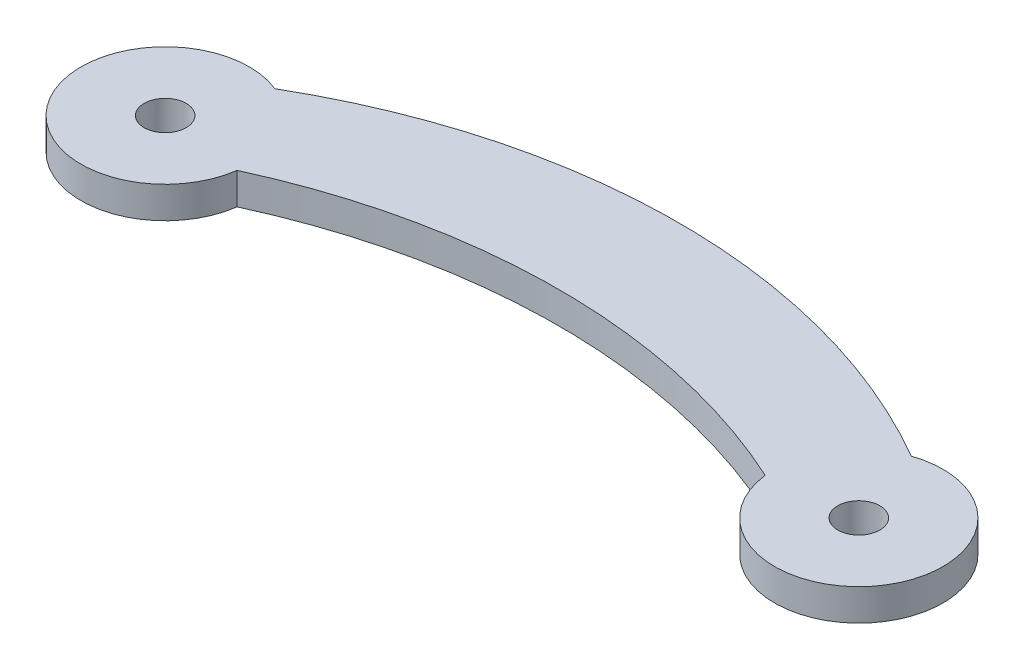
ISO-10303-21;
HEADER;
FILE_DESCRIPTION(('STEP AP214'),'2;1');
FILE_NAME('part.step','',(''),(''),'','','');
FILE_SCHEMA(('AUTOMOTIVE_DESIGN { 1 0 10303 214 1 1 1 1 }'));
ENDSEC;
DATA;
#1=APPLICATION_CONTEXT('core data for automotive mechanical design processes');
#2=APPLICATION_PROTOCOL_DEFINITION('international standard','automotive_design',2000,#1);
#3=PRODUCT_CONTEXT('',#1,'mechanical');
#4=PRODUCT('Part','Part','',(#3));
#5=PRODUCT_RELATED_PRODUCT_CATEGORY('part','',(#4));
#6=PRODUCT_DEFINITION_FORMATION('','',#4);
#7=PRODUCT_DEFINITION_CONTEXT('part definition',#1,'design');
#8=PRODUCT_DEFINITION('design','',#6,#7);
#9=PRODUCT_DEFINITION_SHAPE('','',#8);
#10=(LENGTH_UNIT() NAMED_UNIT(*) SI_UNIT(.MILLI.,.METRE.));
#11=(NAMED_UNIT(*) PLANE_ANGLE_UNIT() SI_UNIT($,.RADIAN.));
#12=(NAMED_UNIT(*) SI_UNIT($,.STERADIAN.) SOLID_ANGLE_UNIT());
#13=UNCERTAINTY_MEASURE_WITH_UNIT(LENGTH_MEASURE(1.E-05),#10,'distance_accuracy_value','');
#14=(GEOMETRIC_REPRESENTATION_CONTEXT(3) GLOBAL_UNCERTAINTY_ASSIGNED_CONTEXT((#13)) GLOBAL_UNIT_ASSIGNED_CONTEXT((#10,
#11,#12)) REPRESENTATION_CONTEXT('',''));
#15=CARTESIAN_POINT('',(0.,0.,0.));
#16=DIRECTION('',(0.,0.,1.));
#17=DIRECTION('',(1.,0.,0.));
#18=AXIS2_PLACEMENT_3D('',#15,#16,#17);
#19=CARTESIAN_POINT('',(16.6042481961613,1.5,22.2185711703313));
#20=DIRECTION('',(0.,-1.,0.));
#21=DIRECTION('',(0.,0.,-1.));
#22=AXIS2_PLACEMENT_3D('',#19,#20,#21);
#23=CYLINDRICAL_SURFACE('',#22,30.);
#24=CARTESIAN_POINT('',(16.6042481961613,0.,22.2185711703313));
#25=DIRECTION('',(0.,1.,0.));
#26=DIRECTION('',(0.,0.,-1.));
#27=AXIS2_PLACEMENT_3D('',#24,#25,#26);
#28=CIRCLE('',#27,30.);
#29=CARTESIAN_POINT('',(31.702043975481,0.,-3.70548257529189));
#30=VERTEX_POINT('',#29);
#31=CARTESIAN_POINT('',(1.5064524168417,0.,-3.70548257529189));
#32=VERTEX_POINT('',#31);
#33=EDGE_CURVE('E114',#30,#32,#28,.T.);
#34=ORIENTED_EDGE('',*,*,#33,.T.);
#35=DIRECTION('',(0.,-1.,0.));
#36=VECTOR('',#35,1.);
#37=CARTESIAN_POINT('',(1.5064524168417,1.5,-3.70548257529189));
#38=LINE('',#37,#36);
#39=CARTESIAN_POINT('',(1.5064524168417,1.5,-3.70548257529189));
#40=VERTEX_POINT('',#39);
#41=EDGE_CURVE('E11',#40,#32,#38,.T.);
#42=ORIENTED_EDGE('',*,*,#41,.F.);
#43=CARTESIAN_POINT('',(16.6042481961613,1.5,22.2185711703313));
#44=DIRECTION('',(0.,1.,0.));
#45=DIRECTION('',(0.,0.,-1.));
#46=AXIS2_PLACEMENT_3D('',#43,#44,#45);
#47=CIRCLE('',#46,30.);
#48=CARTESIAN_POINT('',(31.702043975481,1.5,-3.70548257529189));
#49=VERTEX_POINT('',#48);
#50=EDGE_CURVE('E97',#49,#40,#47,.T.);
#51=ORIENTED_EDGE('',*,*,#50,.F.);
#52=DIRECTION('',(0.,-1.,0.));
#53=VECTOR('',#52,1.);
#54=CARTESIAN_POINT('',(31.702043975481,1.5,-3.70548257529189));
#55=LINE('',#54,#53);
#56=EDGE_CURVE('E110',#49,#30,#55,.T.);
#57=ORIENTED_EDGE('',*,*,#56,.T.);
#58=EDGE_LOOP('',(#34,#42,#51,#57));
#59=FACE_BOUND('',#58,.T.);
#60=ADVANCED_FACE('F43',(#59),#23,.T.);
#61=CARTESIAN_POINT('',(0.,1.5,0.));
#62=DIRECTION('',(0.,-1.,0.));
#63=DIRECTION('',(0.,0.,-1.));
#64=AXIS2_PLACEMENT_3D('',#61,#62,#63);
#65=CYLINDRICAL_SURFACE('',#64,4.);
#66=CARTESIAN_POINT('',(0.,0.,0.));
#67=DIRECTION('',(0.,1.,0.));
#68=DIRECTION('',(0.,0.,1.));
#69=AXIS2_PLACEMENT_3D('',#66,#67,#68);
#70=CIRCLE('',#69,4.);
#71=CARTESIAN_POINT('',(3.96226825190421,0.,0.548115225068557));
#72=VERTEX_POINT('',#71);
#73=EDGE_CURVE('E102',#32,#72,#70,.T.);
#74=ORIENTED_EDGE('',*,*,#73,.T.);
#75=DIRECTION('',(0.,-1.,0.));
#76=VECTOR('',#75,1.);
#77=CARTESIAN_POINT('',(3.96226825190421,1.5,0.548115225068557));
#78=LINE('',#77,#76);
#79=CARTESIAN_POINT('',(3.96226825190421,1.5,0.548115225068557));
#80=VERTEX_POINT('',#79);
#81=EDGE_CURVE('E53',#80,#72,#78,.T.);
#82=ORIENTED_EDGE('',*,*,#81,.F.);
#83=CARTESIAN_POINT('',(0.,1.5,0.));
#84=DIRECTION('',(0.,1.,0.));
#85=DIRECTION('',(0.,0.,1.));
#86=AXIS2_PLACEMENT_3D('',#83,#84,#85);
#87=CIRCLE('',#86,4.);
#88=EDGE_CURVE('E92',#40,#80,#87,.T.);
#89=ORIENTED_EDGE('',*,*,#88,.F.);
#90=ORIENTED_EDGE('',*,*,#41,.T.);
#91=EDGE_LOOP('',(#74,#82,#89,#90));
#92=FACE_BOUND('',#91,.T.);
#93=ADVANCED_FACE('F101',(#92),#65,.T.);
#94=CARTESIAN_POINT('',(16.4949907232611,1.5,27.8048734229164));
#95=DIRECTION('',(0.,-1.,0.));
#96=DIRECTION('',(0.,0.,-1.));
#97=AXIS2_PLACEMENT_3D('',#94,#95,#96);
#98=CYLINDRICAL_SURFACE('',#97,30.);
#99=CARTESIAN_POINT('',(16.4949907232611,0.,27.8048734229164));
#100=DIRECTION('',(0.,-1.,0.));
#101=DIRECTION('',(0.,0.,-1.));
#102=AXIS2_PLACEMENT_3D('',#99,#100,#101);
#103=CIRCLE('',#102,30.);
#104=CARTESIAN_POINT('',(29.027713194618,0.,0.548115225068559));
#105=VERTEX_POINT('',#104);
#106=EDGE_CURVE('E79',#72,#105,#103,.T.);
#107=ORIENTED_EDGE('',*,*,#106,.T.);
#108=DIRECTION('',(0.,-1.,0.));
#109=VECTOR('',#108,1.);
#110=CARTESIAN_POINT('',(29.027713194618,1.5,0.548115225068559));
#111=LINE('',#110,#109);
#112=CARTESIAN_POINT('',(29.027713194618,1.5,0.548115225068559));
#113=VERTEX_POINT('',#112);
#114=EDGE_CURVE('E104',#113,#105,#111,.T.);
#115=ORIENTED_EDGE('',*,*,#114,.F.);
#116=CARTESIAN_POINT('',(16.4949907232611,1.5,27.8048734229164));
#117=DIRECTION('',(0.,-1.,0.));
#118=DIRECTION('',(0.,0.,-1.));
#119=AXIS2_PLACEMENT_3D('',#116,#117,#118);
#120=CIRCLE('',#119,30.);
#121=EDGE_CURVE('E95',#80,#113,#120,.T.);
#122=ORIENTED_EDGE('',*,*,#121,.F.);
#123=ORIENTED_EDGE('',*,*,#81,.T.);
#124=EDGE_LOOP('',(#107,#115,#122,#123));
#125=FACE_BOUND('',#124,.T.);
#126=ADVANCED_FACE('F106',(#125),#98,.F.);
#127=CARTESIAN_POINT('',(33.,1.5,0.0780752950749449));
#128=DIRECTION('',(0.,-1.,0.));
#129=DIRECTION('',(0.,0.,-1.));
#130=AXIS2_PLACEMENT_3D('',#127,#128,#129);
#131=CYLINDRICAL_SURFACE('',#130,4.00000000000001);
#132=CARTESIAN_POINT('',(33.,0.,0.0780752950749449));
#133=DIRECTION('',(0.,1.,0.));
#134=DIRECTION('',(0.,0.,1.));
#135=AXIS2_PLACEMENT_3D('',#132,#133,#134);
#136=CIRCLE('',#135,4.00000000000001);
#137=EDGE_CURVE('E85',#105,#30,#136,.T.);
#138=ORIENTED_EDGE('',*,*,#137,.T.);
#139=ORIENTED_EDGE('',*,*,#56,.F.);
#140=CARTESIAN_POINT('',(33.,1.5,0.0780752950749449));
#141=DIRECTION('',(0.,1.,0.));
#142=DIRECTION('',(0.,0.,1.));
#143=AXIS2_PLACEMENT_3D('',#140,#141,#142);
#144=CIRCLE('',#143,4.00000000000001);
#145=EDGE_CURVE('E62',#113,#49,#144,.T.);
#146=ORIENTED_EDGE('',*,*,#145,.F.);
#147=ORIENTED_EDGE('',*,*,#114,.T.);
#148=EDGE_LOOP('',(#138,#139,#146,#147));
#149=FACE_BOUND('',#148,.T.);
#150=ADVANCED_FACE('F151',(#149),#131,.T.);
#151=CARTESIAN_POINT('',(24.8021240980807,1.5,11.1483232327031));
#152=DIRECTION('',(0.,-1.,0.));
#153=DIRECTION('',(0.,0.,-1.));
#154=AXIS2_PLACEMENT_3D('',#151,#152,#153);
#155=PLANE('',#154);
#156=CARTESIAN_POINT('',(33.,1.5,0.0780752950749449));
#157=DIRECTION('',(0.,1.,0.));
#158=DIRECTION('',(0.,0.,1.));
#159=AXIS2_PLACEMENT_3D('',#156,#157,#158);
#160=CIRCLE('',#159,0.999999999999998);
#161=CARTESIAN_POINT('',(33.,1.5,1.07807529507494));
#162=VERTEX_POINT('',#161);
#163=EDGE_CURVE('E130',#162,#162,#160,.T.);
#164=ORIENTED_EDGE('',*,*,#163,.F.);
#165=EDGE_LOOP('',(#164));
#166=FACE_BOUND('',#165,.T.);
#167=CARTESIAN_POINT('',(0.,1.5,0.));
#168=DIRECTION('',(0.,1.,0.));
#169=DIRECTION('',(0.,0.,1.));
#170=AXIS2_PLACEMENT_3D('',#167,#168,#169);
#171=CIRCLE('',#170,1.);
#172=CARTESIAN_POINT('',(0.,1.5,1.));
#173=VERTEX_POINT('',#172);
#174=EDGE_CURVE('E137',#173,#173,#171,.T.);
#175=ORIENTED_EDGE('',*,*,#174,.F.);
#176=EDGE_LOOP('',(#175));
#177=FACE_BOUND('',#176,.T.);
#178=ORIENTED_EDGE('',*,*,#50,.T.);
#179=ORIENTED_EDGE('',*,*,#88,.T.);
#180=ORIENTED_EDGE('',*,*,#121,.T.);
#181=ORIENTED_EDGE('',*,*,#145,.T.);
#182=EDGE_LOOP('',(#178,#179,#180,#181));
#183=FACE_BOUND('',#182,.T.);
#184=ADVANCED_FACE('F93',(#166,#177,#183),#155,.F.);
#185=CARTESIAN_POINT('',(24.8021240980807,0.,11.1483232327031));
#186=DIRECTION('',(0.,-1.,0.));
#187=DIRECTION('',(0.,0.,-1.));
#188=AXIS2_PLACEMENT_3D('',#185,#186,#187);
#189=PLANE('',#188);
#190=CARTESIAN_POINT('',(33.,0.,0.0780752950749449));
#191=DIRECTION('',(0.,-1.,0.));
#192=DIRECTION('',(0.,0.,-1.));
#193=AXIS2_PLACEMENT_3D('',#190,#191,#192);
#194=CIRCLE('',#193,0.999999999999998);
#195=CARTESIAN_POINT('',(33.,0.,-0.921924704925053));
#196=VERTEX_POINT('',#195);
#197=EDGE_CURVE('E46',#196,#196,#194,.T.);
#198=ORIENTED_EDGE('',*,*,#197,.F.);
#199=EDGE_LOOP('',(#198));
#200=FACE_BOUND('',#199,.T.);
#201=CARTESIAN_POINT('',(0.,0.,0.));
#202=DIRECTION('',(0.,-1.,0.));
#203=DIRECTION('',(0.,0.,-1.));
#204=AXIS2_PLACEMENT_3D('',#201,#202,#203);
#205=CIRCLE('',#204,1.);
#206=CARTESIAN_POINT('',(0.,0.,-1.));
#207=VERTEX_POINT('',#206);
#208=EDGE_CURVE('E127',#207,#207,#205,.T.);
#209=ORIENTED_EDGE('',*,*,#208,.F.);
#210=EDGE_LOOP('',(#209));
#211=FACE_BOUND('',#210,.T.);
#212=ORIENTED_EDGE('',*,*,#33,.F.);
#213=ORIENTED_EDGE('',*,*,#137,.F.);
#214=ORIENTED_EDGE('',*,*,#106,.F.);
#215=ORIENTED_EDGE('',*,*,#73,.F.);
#216=EDGE_LOOP('',(#212,#213,#214,#215));
#217=FACE_BOUND('',#216,.T.);
#218=ADVANCED_FACE('F150',(#200,#211,#217),#189,.T.);
#219=CARTESIAN_POINT('',(0.,-10.,0.));
#220=DIRECTION('',(0.,1.,0.));
#221=DIRECTION('',(0.,0.,1.));
#222=AXIS2_PLACEMENT_3D('',#219,#220,#221);
#223=CYLINDRICAL_SURFACE('',#222,1.);
#224=ORIENTED_EDGE('',*,*,#208,.T.);
#225=EDGE_LOOP('',(#224));
#226=FACE_BOUND('',#225,.T.);
#227=ORIENTED_EDGE('',*,*,#174,.T.);
#228=EDGE_LOOP('',(#227));
#229=FACE_BOUND('',#228,.T.);
#230=ADVANCED_FACE('F147',(#226,#229),#223,.F.);
#231=CARTESIAN_POINT('',(33.,-10.,0.0780752950749449));
#232=DIRECTION('',(0.,1.,0.));
#233=DIRECTION('',(0.,0.,1.));
#234=AXIS2_PLACEMENT_3D('',#231,#232,#233);
#235=CYLINDRICAL_SURFACE('',#234,0.999999999999998);
#236=ORIENTED_EDGE('',*,*,#197,.T.);
#237=EDGE_LOOP('',(#236));
#238=FACE_BOUND('',#237,.T.);
#239=ORIENTED_EDGE('',*,*,#163,.T.);
#240=EDGE_LOOP('',(#239));
#241=FACE_BOUND('',#240,.T.);
#242=ADVANCED_FACE('F201',(#238,#241),#235,.F.);
#243=CLOSED_SHELL('',(#60,#93,#126,#150,#184,#218,#230,#242));
#244=MANIFOLD_SOLID_BREP('B2',#243);
#245=ADVANCED_BREP_SHAPE_REPRESENTATION('',(#18,#244),#14);
#246=SHAPE_DEFINITION_REPRESENTATION(#9,#245);
ENDSEC;
END-ISO-10303-21;
